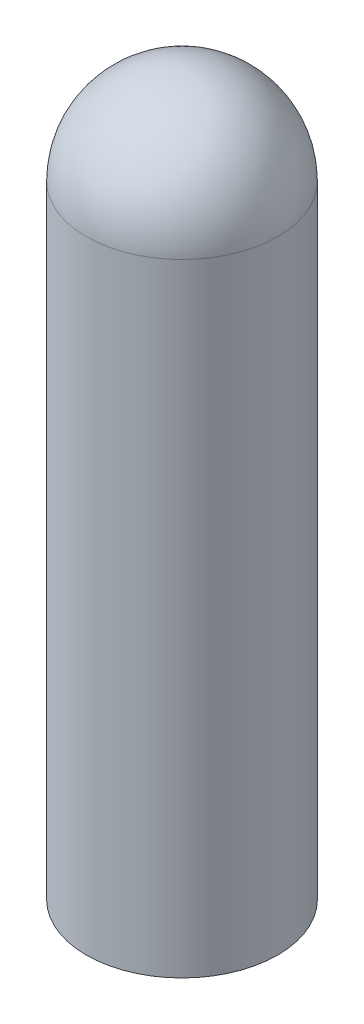
ISO-10303-21;
HEADER;
FILE_DESCRIPTION(('STEP AP214'),'2;1');
FILE_NAME('part.step','',(''),(''),'','','');
FILE_SCHEMA(('AUTOMOTIVE_DESIGN { 1 0 10303 214 1 1 1 1 }'));
ENDSEC;
DATA;
#1=APPLICATION_CONTEXT('core data for automotive mechanical design processes');
#2=APPLICATION_PROTOCOL_DEFINITION('international standard','automotive_design',2000,#1);
#3=PRODUCT_CONTEXT('',#1,'mechanical');
#4=PRODUCT('Part','Part','',(#3));
#5=PRODUCT_RELATED_PRODUCT_CATEGORY('part','',(#4));
#6=PRODUCT_DEFINITION_FORMATION('','',#4);
#7=PRODUCT_DEFINITION_CONTEXT('part definition',#1,'design');
#8=PRODUCT_DEFINITION('design','',#6,#7);
#9=PRODUCT_DEFINITION_SHAPE('','',#8);
#10=(LENGTH_UNIT() NAMED_UNIT(*) SI_UNIT(.MILLI.,.METRE.));
#11=(NAMED_UNIT(*) PLANE_ANGLE_UNIT() SI_UNIT($,.RADIAN.));
#12=(NAMED_UNIT(*) SI_UNIT($,.STERADIAN.) SOLID_ANGLE_UNIT());
#13=UNCERTAINTY_MEASURE_WITH_UNIT(LENGTH_MEASURE(1.E-05),#10,'distance_accuracy_value','');
#14=(GEOMETRIC_REPRESENTATION_CONTEXT(3) GLOBAL_UNCERTAINTY_ASSIGNED_CONTEXT((#13)) GLOBAL_UNIT_ASSIGNED_CONTEXT((#10,
#11,#12)) REPRESENTATION_CONTEXT('',''));
#15=CARTESIAN_POINT('',(0.,0.,0.));
#16=DIRECTION('',(0.,0.,1.));
#17=DIRECTION('',(1.,0.,0.));
#18=AXIS2_PLACEMENT_3D('',#15,#16,#17);
#19=CARTESIAN_POINT('',(0.,15.,0.));
#20=DIRECTION('',(0.,-1.,0.));
#21=DIRECTION('',(0.,0.,-1.));
#22=AXIS2_PLACEMENT_3D('',#19,#20,#21);
#23=CYLINDRICAL_SURFACE('',#22,2.);
#24=CARTESIAN_POINT('',(0.,13.,0.));
#25=DIRECTION('',(0.,-1.,0.));
#26=DIRECTION('',(0.,0.,-1.));
#27=AXIS2_PLACEMENT_3D('',#24,#25,#26);
#28=CIRCLE('',#27,2.);
#29=CARTESIAN_POINT('',(0.,13.,-2.));
#30=VERTEX_POINT('',#29);
#31=EDGE_CURVE('E10',#30,#30,#28,.T.);
#32=ORIENTED_EDGE('',*,*,#31,.T.);
#33=EDGE_LOOP('',(#32));
#34=FACE_BOUND('',#33,.T.);
#35=CARTESIAN_POINT('',(0.,0.,0.));
#36=DIRECTION('',(0.,1.,0.));
#37=DIRECTION('',(0.,0.,1.));
#38=AXIS2_PLACEMENT_3D('',#35,#36,#37);
#39=CIRCLE('',#38,2.);
#40=CARTESIAN_POINT('',(0.,0.,2.));
#41=VERTEX_POINT('',#40);
#42=EDGE_CURVE('E21',#41,#41,#39,.T.);
#43=ORIENTED_EDGE('',*,*,#42,.T.);
#44=EDGE_LOOP('',(#43));
#45=FACE_BOUND('',#44,.T.);
#46=ADVANCED_FACE('F14',(#34,#45),#23,.T.);
#47=CARTESIAN_POINT('',(0.,0.,0.));
#48=DIRECTION('',(0.,1.,0.));
#49=DIRECTION('',(0.,0.,1.));
#50=AXIS2_PLACEMENT_3D('',#47,#48,#49);
#51=PLANE('',#50);
#52=CARTESIAN_POINT('',(0.,0.,0.));
#53=DIRECTION('',(0.,-1.,0.));
#54=DIRECTION('',(0.,0.,-1.));
#55=AXIS2_PLACEMENT_3D('',#52,#53,#54);
#56=CIRCLE('',#55,1.75);
#57=CARTESIAN_POINT('',(0.,0.,-1.75));
#58=VERTEX_POINT('',#57);
#59=EDGE_CURVE('E29',#58,#58,#56,.T.);
#60=ORIENTED_EDGE('',*,*,#59,.F.);
#61=EDGE_LOOP('',(#60));
#62=FACE_BOUND('',#61,.T.);
#63=ORIENTED_EDGE('',*,*,#42,.F.);
#64=EDGE_LOOP('',(#63));
#65=FACE_BOUND('',#64,.T.);
#66=ADVANCED_FACE('F37',(#62,#65),#51,.F.);
#67=CARTESIAN_POINT('',(0.,13.,0.));
#68=DIRECTION('',(0.,0.,1.));
#69=DIRECTION('',(1.,0.,0.));
#70=AXIS2_PLACEMENT_3D('',#67,#68,#69);
#71=SPHERICAL_SURFACE('',#70,2.);
#72=CARTESIAN_POINT('',(0.,13.,0.));
#73=DIRECTION('',(0.,-1.,0.));
#74=DIRECTION('',(0.,0.,-1.));
#75=AXIS2_PLACEMENT_3D('',#72,#73,#74);
#76=SPHERICAL_SURFACE('',#75,2.);
#77=ORIENTED_EDGE('',*,*,#31,.F.);
#78=EDGE_LOOP('',(#77));
#79=FACE_BOUND('',#78,.T.);
#80=ADVANCED_FACE('F16',(#79),#76,.T.);
#81=CARTESIAN_POINT('',(0.,12.,0.));
#82=DIRECTION('',(0.,-1.,0.));
#83=DIRECTION('',(0.,0.,-1.));
#84=AXIS2_PLACEMENT_3D('',#81,#82,#83);
#85=CYLINDRICAL_SURFACE('',#84,1.75);
#86=CARTESIAN_POINT('',(0.,12.,0.));
#87=DIRECTION('',(0.,-1.,0.));
#88=DIRECTION('',(0.,0.,-1.));
#89=AXIS2_PLACEMENT_3D('',#86,#87,#88);
#90=CIRCLE('',#89,1.75);
#91=CARTESIAN_POINT('',(0.,12.,-1.75));
#92=VERTEX_POINT('',#91);
#93=EDGE_CURVE('E25',#92,#92,#90,.T.);
#94=ORIENTED_EDGE('',*,*,#93,.F.);
#95=EDGE_LOOP('',(#94));
#96=FACE_BOUND('',#95,.T.);
#97=ORIENTED_EDGE('',*,*,#59,.T.);
#98=EDGE_LOOP('',(#97));
#99=FACE_BOUND('',#98,.T.);
#100=ADVANCED_FACE('F35',(#96,#99),#85,.F.);
#101=CARTESIAN_POINT('',(0.,12.,0.));
#102=DIRECTION('',(0.,-1.,0.));
#103=DIRECTION('',(0.,0.,-1.));
#104=AXIS2_PLACEMENT_3D('',#101,#102,#103);
#105=PLANE('',#104);
#106=ORIENTED_EDGE('',*,*,#93,.T.);
#107=EDGE_LOOP('',(#106));
#108=FACE_BOUND('',#107,.T.);
#109=ADVANCED_FACE('F50',(#108),#105,.T.);
#110=CLOSED_SHELL('',(#46,#66,#80,#100,#109));
#111=MANIFOLD_SOLID_BREP('B1',#110);
#112=ADVANCED_BREP_SHAPE_REPRESENTATION('',(#18,#111),#14);
#113=SHAPE_DEFINITION_REPRESENTATION(#9,#112);
ENDSEC;
END-ISO-10303-21;
